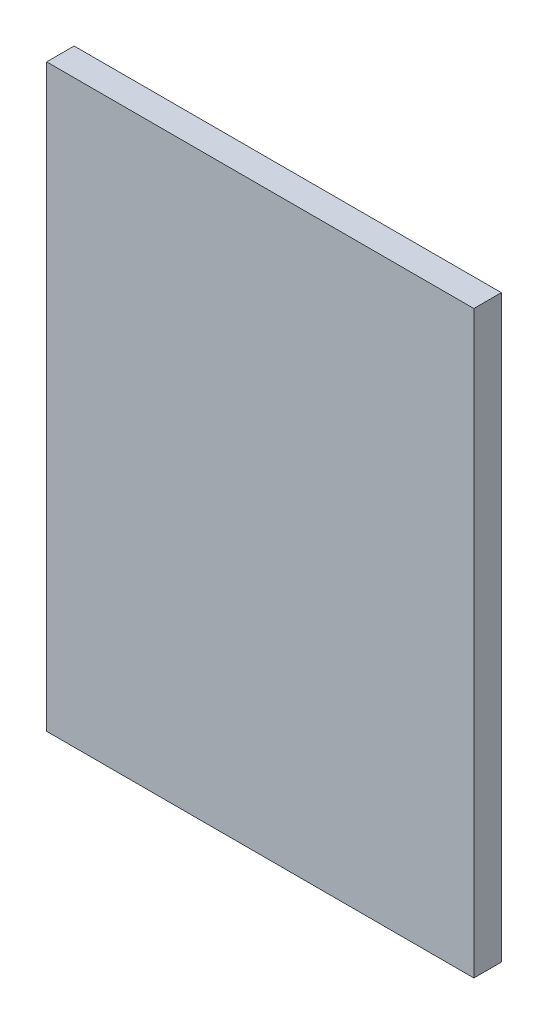
ISO-10303-21;
HEADER;
FILE_DESCRIPTION(('STEP AP214'),'2;1');
FILE_NAME('part.step','',(''),(''),'','','');
FILE_SCHEMA(('AUTOMOTIVE_DESIGN { 1 0 10303 214 1 1 1 1 }'));
ENDSEC;
DATA;
#1=APPLICATION_CONTEXT('core data for automotive mechanical design processes');
#2=APPLICATION_PROTOCOL_DEFINITION('international standard','automotive_design',2000,#1);
#3=PRODUCT_CONTEXT('',#1,'mechanical');
#4=PRODUCT('Part','Part','',(#3));
#5=PRODUCT_RELATED_PRODUCT_CATEGORY('part','',(#4));
#6=PRODUCT_DEFINITION_FORMATION('','',#4);
#7=PRODUCT_DEFINITION_CONTEXT('part definition',#1,'design');
#8=PRODUCT_DEFINITION('design','',#6,#7);
#9=PRODUCT_DEFINITION_SHAPE('','',#8);
#10=(LENGTH_UNIT() NAMED_UNIT(*) SI_UNIT(.MILLI.,.METRE.));
#11=(NAMED_UNIT(*) PLANE_ANGLE_UNIT() SI_UNIT($,.RADIAN.));
#12=(NAMED_UNIT(*) SI_UNIT($,.STERADIAN.) SOLID_ANGLE_UNIT());
#13=UNCERTAINTY_MEASURE_WITH_UNIT(LENGTH_MEASURE(1.E-05),#10,'distance_accuracy_value','');
#14=(GEOMETRIC_REPRESENTATION_CONTEXT(3) GLOBAL_UNCERTAINTY_ASSIGNED_CONTEXT((#13)) GLOBAL_UNIT_ASSIGNED_CONTEXT((#10,
#11,#12)) REPRESENTATION_CONTEXT('',''));
#15=CARTESIAN_POINT('',(0.,0.,0.));
#16=DIRECTION('',(0.,0.,1.));
#17=DIRECTION('',(1.,0.,0.));
#18=AXIS2_PLACEMENT_3D('',#15,#16,#17);
#19=CARTESIAN_POINT('',(140.,190.,18.));
#20=DIRECTION('',(-1.,0.,0.));
#21=DIRECTION('',(0.,-1.,0.));
#22=AXIS2_PLACEMENT_3D('',#19,#20,#21);
#23=PLANE('',#22);
#24=DIRECTION('',(0.,1.,0.));
#25=VECTOR('',#24,1.);
#26=CARTESIAN_POINT('',(140.,190.,0.));
#27=LINE('',#26,#25);
#28=CARTESIAN_POINT('',(140.,-190.,0.));
#29=VERTEX_POINT('',#28);
#30=CARTESIAN_POINT('',(140.,190.,0.));
#31=VERTEX_POINT('',#30);
#32=EDGE_CURVE('E96',#29,#31,#27,.T.);
#33=ORIENTED_EDGE('',*,*,#32,.T.);
#34=DIRECTION('',(0.,0.,-1.));
#35=VECTOR('',#34,1.);
#36=CARTESIAN_POINT('',(140.,190.,18.));
#37=LINE('',#36,#35);
#38=CARTESIAN_POINT('',(140.,190.,18.));
#39=VERTEX_POINT('',#38);
#40=EDGE_CURVE('E11',#39,#31,#37,.T.);
#41=ORIENTED_EDGE('',*,*,#40,.F.);
#42=DIRECTION('',(0.,1.,0.));
#43=VECTOR('',#42,1.);
#44=CARTESIAN_POINT('',(140.,190.,18.));
#45=LINE('',#44,#43);
#46=CARTESIAN_POINT('',(140.,-190.,18.));
#47=VERTEX_POINT('',#46);
#48=EDGE_CURVE('E84',#47,#39,#45,.T.);
#49=ORIENTED_EDGE('',*,*,#48,.F.);
#50=DIRECTION('',(0.,0.,-1.));
#51=VECTOR('',#50,1.);
#52=CARTESIAN_POINT('',(140.,-190.,18.));
#53=LINE('',#52,#51);
#54=EDGE_CURVE('E92',#47,#29,#53,.T.);
#55=ORIENTED_EDGE('',*,*,#54,.T.);
#56=EDGE_LOOP('',(#33,#41,#49,#55));
#57=FACE_BOUND('',#56,.T.);
#58=ADVANCED_FACE('F33',(#57),#23,.F.);
#59=CARTESIAN_POINT('',(-140.,190.,18.));
#60=DIRECTION('',(0.,-1.,0.));
#61=DIRECTION('',(0.,0.,-1.));
#62=AXIS2_PLACEMENT_3D('',#59,#60,#61);
#63=PLANE('',#62);
#64=DIRECTION('',(-1.,0.,0.));
#65=VECTOR('',#64,1.);
#66=CARTESIAN_POINT('',(-140.,190.,0.));
#67=LINE('',#66,#65);
#68=CARTESIAN_POINT('',(-140.,190.,0.));
#69=VERTEX_POINT('',#68);
#70=EDGE_CURVE('E88',#31,#69,#67,.T.);
#71=ORIENTED_EDGE('',*,*,#70,.T.);
#72=DIRECTION('',(0.,0.,-1.));
#73=VECTOR('',#72,1.);
#74=CARTESIAN_POINT('',(-140.,190.,18.));
#75=LINE('',#74,#73);
#76=CARTESIAN_POINT('',(-140.,190.,18.));
#77=VERTEX_POINT('',#76);
#78=EDGE_CURVE('E41',#77,#69,#75,.T.);
#79=ORIENTED_EDGE('',*,*,#78,.F.);
#80=DIRECTION('',(-1.,0.,0.));
#81=VECTOR('',#80,1.);
#82=CARTESIAN_POINT('',(-140.,190.,18.));
#83=LINE('',#82,#81);
#84=EDGE_CURVE('E79',#39,#77,#83,.T.);
#85=ORIENTED_EDGE('',*,*,#84,.F.);
#86=ORIENTED_EDGE('',*,*,#40,.T.);
#87=EDGE_LOOP('',(#71,#79,#85,#86));
#88=FACE_BOUND('',#87,.T.);
#89=ADVANCED_FACE('F87',(#88),#63,.F.);
#90=CARTESIAN_POINT('',(-140.,190.,18.));
#91=DIRECTION('',(1.,0.,0.));
#92=DIRECTION('',(0.,1.,0.));
#93=AXIS2_PLACEMENT_3D('',#90,#91,#92);
#94=PLANE('',#93);
#95=DIRECTION('',(0.,-1.,0.));
#96=VECTOR('',#95,1.);
#97=CARTESIAN_POINT('',(-140.,190.,0.));
#98=LINE('',#97,#96);
#99=CARTESIAN_POINT('',(-140.,-190.,0.));
#100=VERTEX_POINT('',#99);
#101=EDGE_CURVE('E66',#69,#100,#98,.T.);
#102=ORIENTED_EDGE('',*,*,#101,.T.);
#103=DIRECTION('',(0.,0.,-1.));
#104=VECTOR('',#103,1.);
#105=CARTESIAN_POINT('',(-140.,-190.,18.));
#106=LINE('',#105,#104);
#107=CARTESIAN_POINT('',(-140.,-190.,18.));
#108=VERTEX_POINT('',#107);
#109=EDGE_CURVE('E89',#108,#100,#106,.T.);
#110=ORIENTED_EDGE('',*,*,#109,.F.);
#111=DIRECTION('',(0.,-1.,0.));
#112=VECTOR('',#111,1.);
#113=CARTESIAN_POINT('',(-140.,190.,18.));
#114=LINE('',#113,#112);
#115=EDGE_CURVE('E82',#77,#108,#114,.T.);
#116=ORIENTED_EDGE('',*,*,#115,.F.);
#117=ORIENTED_EDGE('',*,*,#78,.T.);
#118=EDGE_LOOP('',(#102,#110,#116,#117));
#119=FACE_BOUND('',#118,.T.);
#120=ADVANCED_FACE('F90',(#119),#94,.F.);
#121=CARTESIAN_POINT('',(-140.,-190.,18.));
#122=DIRECTION('',(0.,1.,0.));
#123=DIRECTION('',(0.,0.,1.));
#124=AXIS2_PLACEMENT_3D('',#121,#122,#123);
#125=PLANE('',#124);
#126=DIRECTION('',(1.,0.,0.));
#127=VECTOR('',#126,1.);
#128=CARTESIAN_POINT('',(-140.,-190.,0.));
#129=LINE('',#128,#127);
#130=EDGE_CURVE('E72',#100,#29,#129,.T.);
#131=ORIENTED_EDGE('',*,*,#130,.T.);
#132=ORIENTED_EDGE('',*,*,#54,.F.);
#133=DIRECTION('',(1.,0.,0.));
#134=VECTOR('',#133,1.);
#135=CARTESIAN_POINT('',(-140.,-190.,18.));
#136=LINE('',#135,#134);
#137=EDGE_CURVE('E49',#108,#47,#136,.T.);
#138=ORIENTED_EDGE('',*,*,#137,.F.);
#139=ORIENTED_EDGE('',*,*,#109,.T.);
#140=EDGE_LOOP('',(#131,#132,#138,#139));
#141=FACE_BOUND('',#140,.T.);
#142=ADVANCED_FACE('F103',(#141),#125,.F.);
#143=CARTESIAN_POINT('',(0.,0.,18.));
#144=DIRECTION('',(0.,0.,1.));
#145=DIRECTION('',(1.,0.,0.));
#146=AXIS2_PLACEMENT_3D('',#143,#144,#145);
#147=PLANE('',#146);
#148=ORIENTED_EDGE('',*,*,#48,.T.);
#149=ORIENTED_EDGE('',*,*,#84,.T.);
#150=ORIENTED_EDGE('',*,*,#115,.T.);
#151=ORIENTED_EDGE('',*,*,#137,.T.);
#152=EDGE_LOOP('',(#148,#149,#150,#151));
#153=FACE_BOUND('',#152,.T.);
#154=ADVANCED_FACE('F80',(#153),#147,.T.);
#155=CARTESIAN_POINT('',(0.,0.,0.));
#156=DIRECTION('',(0.,0.,1.));
#157=DIRECTION('',(1.,0.,0.));
#158=AXIS2_PLACEMENT_3D('',#155,#156,#157);
#159=PLANE('',#158);
#160=ORIENTED_EDGE('',*,*,#32,.F.);
#161=ORIENTED_EDGE('',*,*,#130,.F.);
#162=ORIENTED_EDGE('',*,*,#101,.F.);
#163=ORIENTED_EDGE('',*,*,#70,.F.);
#164=EDGE_LOOP('',(#160,#161,#162,#163));
#165=FACE_BOUND('',#164,.T.);
#166=ADVANCED_FACE('F106',(#165),#159,.F.);
#167=CLOSED_SHELL('',(#58,#89,#120,#142,#154,#166));
#168=MANIFOLD_SOLID_BREP('B2',#167);
#169=ADVANCED_BREP_SHAPE_REPRESENTATION('',(#18,#168),#14);
#170=SHAPE_DEFINITION_REPRESENTATION(#9,#169);
ENDSEC;
END-ISO-10303-21;
